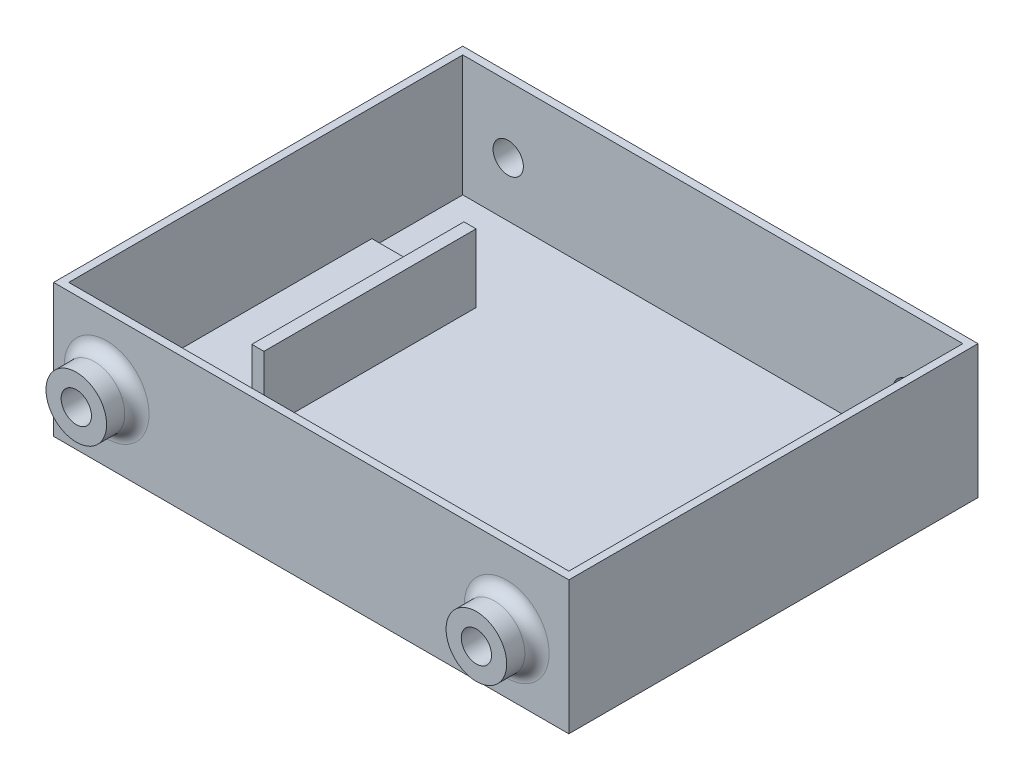
ISO-10303-21;
HEADER;
FILE_DESCRIPTION(('STEP AP214'),'2;1');
FILE_NAME('part.step','',(''),(''),'','','');
FILE_SCHEMA(('AUTOMOTIVE_DESIGN { 1 0 10303 214 1 1 1 1 }'));
ENDSEC;
DATA;
#1=APPLICATION_CONTEXT('core data for automotive mechanical design processes');
#2=APPLICATION_PROTOCOL_DEFINITION('international standard','automotive_design',2000,#1);
#3=PRODUCT_CONTEXT('',#1,'mechanical');
#4=PRODUCT('Part','Part','',(#3));
#5=PRODUCT_RELATED_PRODUCT_CATEGORY('part','',(#4));
#6=PRODUCT_DEFINITION_FORMATION('','',#4);
#7=PRODUCT_DEFINITION_CONTEXT('part definition',#1,'design');
#8=PRODUCT_DEFINITION('design','',#6,#7);
#9=PRODUCT_DEFINITION_SHAPE('','',#8);
#10=(LENGTH_UNIT() NAMED_UNIT(*) SI_UNIT(.MILLI.,.METRE.));
#11=(NAMED_UNIT(*) PLANE_ANGLE_UNIT() SI_UNIT($,.RADIAN.));
#12=(NAMED_UNIT(*) SI_UNIT($,.STERADIAN.) SOLID_ANGLE_UNIT());
#13=UNCERTAINTY_MEASURE_WITH_UNIT(LENGTH_MEASURE(1.E-05),#10,'distance_accuracy_value','');
#14=(GEOMETRIC_REPRESENTATION_CONTEXT(3) GLOBAL_UNCERTAINTY_ASSIGNED_CONTEXT((#13)) GLOBAL_UNIT_ASSIGNED_CONTEXT((#10,
#11,#12)) REPRESENTATION_CONTEXT('',''));
#15=CARTESIAN_POINT('',(0.,0.,0.));
#16=DIRECTION('',(0.,0.,1.));
#17=DIRECTION('',(1.,0.,0.));
#18=AXIS2_PLACEMENT_3D('',#15,#16,#17);
#19=CARTESIAN_POINT('',(0.,4.1275,0.));
#20=DIRECTION('',(0.,1.,0.));
#21=DIRECTION('',(0.,0.,1.));
#22=AXIS2_PLACEMENT_3D('',#19,#20,#21);
#23=PLANE('',#22);
#24=DIRECTION('',(1.,0.,0.));
#25=VECTOR('',#24,1.);
#26=CARTESIAN_POINT('',(23.4315,4.1275,-20.6375));
#27=LINE('',#26,#25);
#28=CARTESIAN_POINT('',(1.58750000000001,4.1275,-20.6375));
#29=VERTEX_POINT('',#28);
#30=CARTESIAN_POINT('',(20.8915,4.1275,-20.6375));
#31=VERTEX_POINT('',#30);
#32=EDGE_CURVE('E76',#29,#31,#27,.T.);
#33=ORIENTED_EDGE('',*,*,#32,.T.);
#34=DIRECTION('',(0.,0.,1.));
#35=VECTOR('',#34,1.);
#36=CARTESIAN_POINT('',(20.8915,4.1275,-65.0875));
#37=LINE('',#36,#35);
#38=CARTESIAN_POINT('',(20.8915,4.1275,-65.0875));
#39=VERTEX_POINT('',#38);
#40=EDGE_CURVE('E80',#39,#31,#37,.T.);
#41=ORIENTED_EDGE('',*,*,#40,.F.);
#42=DIRECTION('',(-1.,0.,0.));
#43=VECTOR('',#42,1.);
#44=CARTESIAN_POINT('',(23.4315,4.1275,-65.0875));
#45=LINE('',#44,#43);
#46=CARTESIAN_POINT('',(1.5875,4.1275,-65.0875));
#47=VERTEX_POINT('',#46);
#48=EDGE_CURVE('E199',#39,#47,#45,.T.);
#49=ORIENTED_EDGE('',*,*,#48,.T.);
#50=DIRECTION('',(0.,0.,1.));
#51=VECTOR('',#50,1.);
#52=CARTESIAN_POINT('',(1.5875,4.1275,-20.6375));
#53=LINE('',#52,#51);
#54=EDGE_CURVE('E201',#47,#29,#53,.T.);
#55=ORIENTED_EDGE('',*,*,#54,.T.);
#56=EDGE_LOOP('',(#33,#41,#49,#55));
#57=FACE_BOUND('',#56,.T.);
#58=ADVANCED_FACE('F61',(#57),#23,.T.);
#59=CARTESIAN_POINT('',(1.5875,27.94,-84.1375));
#60=DIRECTION('',(1.,0.,0.));
#61=DIRECTION('',(0.,0.,-1.));
#62=AXIS2_PLACEMENT_3D('',#59,#60,#61);
#63=PLANE('',#62);
#64=ORIENTED_EDGE('',*,*,#54,.F.);
#65=DIRECTION('',(0.,-1.,0.));
#66=VECTOR('',#65,1.);
#67=CARTESIAN_POINT('',(1.5875,4.1275,-65.0875));
#68=LINE('',#67,#66);
#69=CARTESIAN_POINT('',(1.5875,2.54,-65.0875));
#70=VERTEX_POINT('',#69);
#71=EDGE_CURVE('E172',#47,#70,#68,.T.);
#72=ORIENTED_EDGE('',*,*,#71,.T.);
#73=DIRECTION('',(0.,0.,1.));
#74=VECTOR('',#73,1.);
#75=CARTESIAN_POINT('',(1.5875,2.54,-84.1375));
#76=LINE('',#75,#74);
#77=CARTESIAN_POINT('',(1.5875,2.54,-84.1375));
#78=VERTEX_POINT('',#77);
#79=EDGE_CURVE('E228',#78,#70,#76,.T.);
#80=ORIENTED_EDGE('',*,*,#79,.F.);
#81=DIRECTION('',(0.,-1.,0.));
#82=VECTOR('',#81,1.);
#83=CARTESIAN_POINT('',(1.5875,27.94,-84.1375));
#84=LINE('',#83,#82);
#85=CARTESIAN_POINT('',(1.5875,27.94,-84.1375));
#86=VERTEX_POINT('',#85);
#87=EDGE_CURVE('E247',#86,#78,#84,.T.);
#88=ORIENTED_EDGE('',*,*,#87,.F.);
#89=DIRECTION('',(0.,0.,1.));
#90=VECTOR('',#89,1.);
#91=CARTESIAN_POINT('',(1.5875,27.94,-84.1375));
#92=LINE('',#91,#90);
#93=CARTESIAN_POINT('',(1.58750000000001,27.94,-1.5875));
#94=VERTEX_POINT('',#93);
#95=EDGE_CURVE('E234',#86,#94,#92,.T.);
#96=ORIENTED_EDGE('',*,*,#95,.T.);
#97=DIRECTION('',(0.,-1.,0.));
#98=VECTOR('',#97,1.);
#99=CARTESIAN_POINT('',(1.58750000000001,27.94,-1.5875));
#100=LINE('',#99,#98);
#101=CARTESIAN_POINT('',(1.58750000000001,2.54,-1.5875));
#102=VERTEX_POINT('',#101);
#103=EDGE_CURVE('E251',#94,#102,#100,.T.);
#104=ORIENTED_EDGE('',*,*,#103,.T.);
#105=CARTESIAN_POINT('',(1.58750000000001,2.54,-20.6375));
#106=VERTEX_POINT('',#105);
#107=EDGE_CURVE('E244',#106,#102,#76,.T.);
#108=ORIENTED_EDGE('',*,*,#107,.F.);
#109=DIRECTION('',(0.,-1.,0.));
#110=VECTOR('',#109,1.);
#111=CARTESIAN_POINT('',(1.5875,4.1275,-20.6375));
#112=LINE('',#111,#110);
#113=EDGE_CURVE('E212',#29,#106,#112,.T.);
#114=ORIENTED_EDGE('',*,*,#113,.F.);
#115=EDGE_LOOP('',(#64,#72,#80,#88,#96,#104,#108,#114));
#116=FACE_BOUND('',#115,.T.);
#117=ADVANCED_FACE('F364',(#116),#63,.T.);
#118=CARTESIAN_POINT('',(0.,2.54,0.));
#119=DIRECTION('',(0.,-1.,0.));
#120=DIRECTION('',(0.,0.,-1.));
#121=AXIS2_PLACEMENT_3D('',#118,#119,#120);
#122=PLANE('',#121);
#123=DIRECTION('',(-1.,0.,0.));
#124=VECTOR('',#123,1.);
#125=CARTESIAN_POINT('',(23.4315,2.54,-65.0875));
#126=LINE('',#125,#124);
#127=CARTESIAN_POINT('',(23.4315,2.54,-65.0875));
#128=VERTEX_POINT('',#127);
#129=EDGE_CURVE('E207',#128,#70,#126,.T.);
#130=ORIENTED_EDGE('',*,*,#129,.F.);
#131=DIRECTION('',(0.,0.,-1.));
#132=VECTOR('',#131,1.);
#133=CARTESIAN_POINT('',(23.4315,2.54,-20.6375));
#134=LINE('',#133,#132);
#135=CARTESIAN_POINT('',(23.4315,2.54,-20.6375));
#136=VERTEX_POINT('',#135);
#137=EDGE_CURVE('E167',#136,#128,#134,.T.);
#138=ORIENTED_EDGE('',*,*,#137,.F.);
#139=DIRECTION('',(1.,0.,0.));
#140=VECTOR('',#139,1.);
#141=CARTESIAN_POINT('',(23.4315,2.54,-20.6375));
#142=LINE('',#141,#140);
#143=EDGE_CURVE('E202',#106,#136,#142,.T.);
#144=ORIENTED_EDGE('',*,*,#143,.F.);
#145=ORIENTED_EDGE('',*,*,#107,.T.);
#146=DIRECTION('',(1.,0.,0.));
#147=VECTOR('',#146,1.);
#148=CARTESIAN_POINT('',(1.58750000000001,2.54,-1.5875));
#149=LINE('',#148,#147);
#150=CARTESIAN_POINT('',(106.3625,2.54,-1.58750000000001));
#151=VERTEX_POINT('',#150);
#152=EDGE_CURVE('E242',#102,#151,#149,.T.);
#153=ORIENTED_EDGE('',*,*,#152,.T.);
#154=DIRECTION('',(0.,0.,1.));
#155=VECTOR('',#154,1.);
#156=CARTESIAN_POINT('',(106.3625,2.54,-84.1375));
#157=LINE('',#156,#155);
#158=CARTESIAN_POINT('',(106.3625,2.54,-84.1375));
#159=VERTEX_POINT('',#158);
#160=EDGE_CURVE('E239',#159,#151,#157,.T.);
#161=ORIENTED_EDGE('',*,*,#160,.F.);
#162=DIRECTION('',(1.,0.,0.));
#163=VECTOR('',#162,1.);
#164=CARTESIAN_POINT('',(1.5875,2.54,-84.1375));
#165=LINE('',#164,#163);
#166=EDGE_CURVE('E223',#78,#159,#165,.T.);
#167=ORIENTED_EDGE('',*,*,#166,.F.);
#168=ORIENTED_EDGE('',*,*,#79,.T.);
#169=EDGE_LOOP('',(#130,#138,#144,#145,#153,#161,#167,#168));
#170=FACE_BOUND('',#169,.T.);
#171=ADVANCED_FACE('F369',(#170),#122,.F.);
#172=CARTESIAN_POINT('',(0.,2.54,0.));
#173=DIRECTION('',(-1.,0.,0.));
#174=DIRECTION('',(0.,0.,1.));
#175=AXIS2_PLACEMENT_3D('',#172,#173,#174);
#176=PLANE('',#175);
#177=DIRECTION('',(0.,0.,-1.));
#178=VECTOR('',#177,1.);
#179=CARTESIAN_POINT('',(0.,0.,0.));
#180=LINE('',#179,#178);
#181=CARTESIAN_POINT('',(0.,0.,0.));
#182=VERTEX_POINT('',#181);
#183=CARTESIAN_POINT('',(0.,0.,-85.725));
#184=VERTEX_POINT('',#183);
#185=EDGE_CURVE('E270',#182,#184,#180,.T.);
#186=ORIENTED_EDGE('',*,*,#185,.F.);
#187=DIRECTION('',(0.,-1.,0.));
#188=VECTOR('',#187,1.);
#189=CARTESIAN_POINT('',(0.,2.54,0.));
#190=LINE('',#189,#188);
#191=CARTESIAN_POINT('',(0.,27.94,0.));
#192=VERTEX_POINT('',#191);
#193=EDGE_CURVE('E282',#192,#182,#190,.T.);
#194=ORIENTED_EDGE('',*,*,#193,.F.);
#195=DIRECTION('',(0.,0.,1.));
#196=VECTOR('',#195,1.);
#197=CARTESIAN_POINT('',(0.,27.94,0.));
#198=LINE('',#197,#196);
#199=CARTESIAN_POINT('',(0.,27.94,-85.725));
#200=VERTEX_POINT('',#199);
#201=EDGE_CURVE('E261',#200,#192,#198,.T.);
#202=ORIENTED_EDGE('',*,*,#201,.F.);
#203=DIRECTION('',(0.,-1.,0.));
#204=VECTOR('',#203,1.);
#205=CARTESIAN_POINT('',(0.,2.54,-85.725));
#206=LINE('',#205,#204);
#207=EDGE_CURVE('E281',#200,#184,#206,.T.);
#208=ORIENTED_EDGE('',*,*,#207,.T.);
#209=EDGE_LOOP('',(#186,#194,#202,#208));
#210=FACE_BOUND('',#209,.T.);
#211=ADVANCED_FACE('F411',(#210),#176,.T.);
#212=CARTESIAN_POINT('',(0.,2.54,0.));
#213=DIRECTION('',(0.,0.,-1.));
#214=DIRECTION('',(-1.,0.,0.));
#215=AXIS2_PLACEMENT_3D('',#212,#213,#214);
#216=PLANE('',#215);
#217=CARTESIAN_POINT('',(94.9325,12.5146943034764,0.));
#218=DIRECTION('',(0.,0.,-1.));
#219=DIRECTION('',(-1.,0.,0.));
#220=AXIS2_PLACEMENT_3D('',#217,#218,#219);
#221=CIRCLE('',#220,8.89);
#222=CARTESIAN_POINT('',(86.0425,12.5146943034764,0.));
#223=VERTEX_POINT('',#222);
#224=EDGE_CURVE('E303',#223,#223,#221,.T.);
#225=ORIENTED_EDGE('',*,*,#224,.T.);
#226=EDGE_LOOP('',(#225));
#227=FACE_BOUND('',#226,.T.);
#228=CARTESIAN_POINT('',(11.1125,14.0281539984102,0.));
#229=DIRECTION('',(0.,0.,-1.));
#230=DIRECTION('',(-1.,0.,0.));
#231=AXIS2_PLACEMENT_3D('',#228,#229,#230);
#232=CIRCLE('',#231,8.89);
#233=CARTESIAN_POINT('',(2.2225,14.0281539984102,0.));
#234=VERTEX_POINT('',#233);
#235=EDGE_CURVE('E297',#234,#234,#232,.T.);
#236=ORIENTED_EDGE('',*,*,#235,.T.);
#237=EDGE_LOOP('',(#236));
#238=FACE_BOUND('',#237,.T.);
#239=DIRECTION('',(1.,0.,0.));
#240=VECTOR('',#239,1.);
#241=CARTESIAN_POINT('',(0.,0.,0.));
#242=LINE('',#241,#240);
#243=CARTESIAN_POINT('',(107.95,0.,0.));
#244=VERTEX_POINT('',#243);
#245=EDGE_CURVE('E279',#182,#244,#242,.T.);
#246=ORIENTED_EDGE('',*,*,#245,.T.);
#247=DIRECTION('',(0.,-1.,0.));
#248=VECTOR('',#247,1.);
#249=CARTESIAN_POINT('',(107.95,2.54,0.));
#250=LINE('',#249,#248);
#251=CARTESIAN_POINT('',(107.95,27.94,0.));
#252=VERTEX_POINT('',#251);
#253=EDGE_CURVE('E285',#252,#244,#250,.T.);
#254=ORIENTED_EDGE('',*,*,#253,.F.);
#255=DIRECTION('',(1.,0.,0.));
#256=VECTOR('',#255,1.);
#257=CARTESIAN_POINT('',(0.,27.94,0.));
#258=LINE('',#257,#256);
#259=EDGE_CURVE('E264',#192,#252,#258,.T.);
#260=ORIENTED_EDGE('',*,*,#259,.F.);
#261=ORIENTED_EDGE('',*,*,#193,.T.);
#262=EDGE_LOOP('',(#246,#254,#260,#261));
#263=FACE_BOUND('',#262,.T.);
#264=ADVANCED_FACE('F416',(#227,#238,#263),#216,.F.);
#265=CARTESIAN_POINT('',(107.95,2.54,0.));
#266=DIRECTION('',(-1.,0.,0.));
#267=DIRECTION('',(0.,0.,1.));
#268=AXIS2_PLACEMENT_3D('',#265,#266,#267);
#269=PLANE('',#268);
#270=DIRECTION('',(0.,0.,-1.));
#271=VECTOR('',#270,1.);
#272=CARTESIAN_POINT('',(107.95,0.,0.));
#273=LINE('',#272,#271);
#274=CARTESIAN_POINT('',(107.95,0.,-85.725));
#275=VERTEX_POINT('',#274);
#276=EDGE_CURVE('E276',#244,#275,#273,.T.);
#277=ORIENTED_EDGE('',*,*,#276,.T.);
#278=DIRECTION('',(0.,-1.,0.));
#279=VECTOR('',#278,1.);
#280=CARTESIAN_POINT('',(107.95,2.54,-85.725));
#281=LINE('',#280,#279);
#282=CARTESIAN_POINT('',(107.95,27.94,-85.725));
#283=VERTEX_POINT('',#282);
#284=EDGE_CURVE('E288',#283,#275,#281,.T.);
#285=ORIENTED_EDGE('',*,*,#284,.F.);
#286=DIRECTION('',(0.,0.,-1.));
#287=VECTOR('',#286,1.);
#288=CARTESIAN_POINT('',(107.95,27.94,0.));
#289=LINE('',#288,#287);
#290=EDGE_CURVE('E267',#252,#283,#289,.T.);
#291=ORIENTED_EDGE('',*,*,#290,.F.);
#292=ORIENTED_EDGE('',*,*,#253,.T.);
#293=EDGE_LOOP('',(#277,#285,#291,#292));
#294=FACE_BOUND('',#293,.T.);
#295=ADVANCED_FACE('F419',(#294),#269,.F.);
#296=CARTESIAN_POINT('',(0.,2.54,-85.725));
#297=DIRECTION('',(0.,0.,-1.));
#298=DIRECTION('',(-1.,0.,0.));
#299=AXIS2_PLACEMENT_3D('',#296,#297,#298);
#300=PLANE('',#299);
#301=CARTESIAN_POINT('',(11.1125,14.0281539984102,-85.725));
#302=DIRECTION('',(0.,0.,-1.));
#303=DIRECTION('',(-1.,0.,0.));
#304=AXIS2_PLACEMENT_3D('',#301,#302,#303);
#305=CIRCLE('',#304,8.89);
#306=CARTESIAN_POINT('',(2.2225,14.0281539984102,-85.725));
#307=VERTEX_POINT('',#306);
#308=EDGE_CURVE('E69',#307,#307,#305,.F.);
#309=ORIENTED_EDGE('',*,*,#308,.T.);
#310=EDGE_LOOP('',(#309));
#311=FACE_BOUND('',#310,.T.);
#312=CARTESIAN_POINT('',(94.9325,12.5146943034764,-85.725));
#313=DIRECTION('',(0.,0.,-1.));
#314=DIRECTION('',(-1.,0.,0.));
#315=AXIS2_PLACEMENT_3D('',#312,#313,#314);
#316=CIRCLE('',#315,8.89);
#317=CARTESIAN_POINT('',(86.0425,12.5146943034764,-85.725));
#318=VERTEX_POINT('',#317);
#319=EDGE_CURVE('E309',#318,#318,#316,.F.);
#320=ORIENTED_EDGE('',*,*,#319,.T.);
#321=EDGE_LOOP('',(#320));
#322=FACE_BOUND('',#321,.T.);
#323=DIRECTION('',(1.,0.,0.));
#324=VECTOR('',#323,1.);
#325=CARTESIAN_POINT('',(0.,0.,-85.725));
#326=LINE('',#325,#324);
#327=EDGE_CURVE('E273',#184,#275,#326,.T.);
#328=ORIENTED_EDGE('',*,*,#327,.F.);
#329=ORIENTED_EDGE('',*,*,#207,.F.);
#330=DIRECTION('',(-1.,0.,0.));
#331=VECTOR('',#330,1.);
#332=CARTESIAN_POINT('',(0.,27.94,-85.725));
#333=LINE('',#332,#331);
#334=EDGE_CURVE('E250',#283,#200,#333,.T.);
#335=ORIENTED_EDGE('',*,*,#334,.F.);
#336=ORIENTED_EDGE('',*,*,#284,.T.);
#337=EDGE_LOOP('',(#328,#329,#335,#336));
#338=FACE_BOUND('',#337,.T.);
#339=ADVANCED_FACE('F314',(#311,#322,#338),#300,.T.);
#340=CARTESIAN_POINT('',(0.,0.,0.));
#341=DIRECTION('',(0.,-1.,0.));
#342=DIRECTION('',(0.,0.,-1.));
#343=AXIS2_PLACEMENT_3D('',#340,#341,#342);
#344=PLANE('',#343);
#345=ORIENTED_EDGE('',*,*,#185,.T.);
#346=ORIENTED_EDGE('',*,*,#327,.T.);
#347=ORIENTED_EDGE('',*,*,#276,.F.);
#348=ORIENTED_EDGE('',*,*,#245,.F.);
#349=EDGE_LOOP('',(#345,#346,#347,#348));
#350=FACE_BOUND('',#349,.T.);
#351=ADVANCED_FACE('F407',(#350),#344,.T.);
#352=CARTESIAN_POINT('',(0.,27.94,0.));
#353=DIRECTION('',(0.,1.,0.));
#354=DIRECTION('',(0.,0.,1.));
#355=AXIS2_PLACEMENT_3D('',#352,#353,#354);
#356=PLANE('',#355);
#357=DIRECTION('',(1.,0.,0.));
#358=VECTOR('',#357,1.);
#359=CARTESIAN_POINT('',(1.5875,27.94,-84.1375));
#360=LINE('',#359,#358);
#361=CARTESIAN_POINT('',(106.3625,27.94,-84.1375));
#362=VERTEX_POINT('',#361);
#363=EDGE_CURVE('E224',#86,#362,#360,.T.);
#364=ORIENTED_EDGE('',*,*,#363,.T.);
#365=DIRECTION('',(0.,0.,1.));
#366=VECTOR('',#365,1.);
#367=CARTESIAN_POINT('',(106.3625,27.94,-84.1375));
#368=LINE('',#367,#366);
#369=CARTESIAN_POINT('',(106.3625,27.94,-1.58750000000001));
#370=VERTEX_POINT('',#369);
#371=EDGE_CURVE('E227',#362,#370,#368,.T.);
#372=ORIENTED_EDGE('',*,*,#371,.T.);
#373=DIRECTION('',(1.,0.,0.));
#374=VECTOR('',#373,1.);
#375=CARTESIAN_POINT('',(1.58750000000001,27.94,-1.5875));
#376=LINE('',#375,#374);
#377=EDGE_CURVE('E231',#94,#370,#376,.T.);
#378=ORIENTED_EDGE('',*,*,#377,.F.);
#379=ORIENTED_EDGE('',*,*,#95,.F.);
#380=EDGE_LOOP('',(#364,#372,#378,#379));
#381=FACE_BOUND('',#380,.T.);
#382=ORIENTED_EDGE('',*,*,#334,.T.);
#383=ORIENTED_EDGE('',*,*,#201,.T.);
#384=ORIENTED_EDGE('',*,*,#259,.T.);
#385=ORIENTED_EDGE('',*,*,#290,.T.);
#386=EDGE_LOOP('',(#382,#383,#384,#385));
#387=FACE_BOUND('',#386,.T.);
#388=ADVANCED_FACE('F403',(#381,#387),#356,.T.);
#389=CARTESIAN_POINT('',(1.5875,27.94,-84.1375));
#390=DIRECTION('',(0.,0.,-1.));
#391=DIRECTION('',(-1.,0.,0.));
#392=AXIS2_PLACEMENT_3D('',#389,#390,#391);
#393=PLANE('',#392);
#394=CARTESIAN_POINT('',(94.9325,12.5146943034764,-84.1375));
#395=DIRECTION('',(0.,0.,-1.));
#396=DIRECTION('',(-1.,0.,0.));
#397=AXIS2_PLACEMENT_3D('',#394,#395,#396);
#398=CIRCLE('',#397,3.175);
#399=CARTESIAN_POINT('',(91.7575,12.5146943034764,-84.1375));
#400=VERTEX_POINT('',#399);
#401=EDGE_CURVE('E216',#400,#400,#398,.T.);
#402=ORIENTED_EDGE('',*,*,#401,.T.);
#403=EDGE_LOOP('',(#402));
#404=FACE_BOUND('',#403,.T.);
#405=CARTESIAN_POINT('',(11.1125,14.0281539984102,-84.1375));
#406=DIRECTION('',(0.,0.,-1.));
#407=DIRECTION('',(-1.,0.,0.));
#408=AXIS2_PLACEMENT_3D('',#405,#406,#407);
#409=CIRCLE('',#408,3.175);
#410=CARTESIAN_POINT('',(7.9375,14.0281539984102,-84.1375));
#411=VERTEX_POINT('',#410);
#412=EDGE_CURVE('E220',#411,#411,#409,.T.);
#413=ORIENTED_EDGE('',*,*,#412,.T.);
#414=EDGE_LOOP('',(#413));
#415=FACE_BOUND('',#414,.T.);
#416=ORIENTED_EDGE('',*,*,#166,.T.);
#417=DIRECTION('',(0.,-1.,0.));
#418=VECTOR('',#417,1.);
#419=CARTESIAN_POINT('',(106.3625,27.94,-84.1375));
#420=LINE('',#419,#418);
#421=EDGE_CURVE('E236',#362,#159,#420,.T.);
#422=ORIENTED_EDGE('',*,*,#421,.F.);
#423=ORIENTED_EDGE('',*,*,#363,.F.);
#424=ORIENTED_EDGE('',*,*,#87,.T.);
#425=EDGE_LOOP('',(#416,#422,#423,#424));
#426=FACE_BOUND('',#425,.T.);
#427=ADVANCED_FACE('F396',(#404,#415,#426),#393,.F.);
#428=CARTESIAN_POINT('',(1.58750000000001,27.94,-1.5875));
#429=DIRECTION('',(0.,0.,-1.));
#430=DIRECTION('',(-1.,0.,0.));
#431=AXIS2_PLACEMENT_3D('',#428,#429,#430);
#432=PLANE('',#431);
#433=CARTESIAN_POINT('',(94.9325,12.5146943034764,-1.58750000000001));
#434=DIRECTION('',(0.,0.,-1.));
#435=DIRECTION('',(-1.,0.,0.));
#436=AXIS2_PLACEMENT_3D('',#433,#434,#435);
#437=CIRCLE('',#436,3.175);
#438=CARTESIAN_POINT('',(91.7575,12.5146943034764,-1.5875));
#439=VERTEX_POINT('',#438);
#440=EDGE_CURVE('E171',#439,#439,#437,.T.);
#441=ORIENTED_EDGE('',*,*,#440,.F.);
#442=EDGE_LOOP('',(#441));
#443=FACE_BOUND('',#442,.T.);
#444=CARTESIAN_POINT('',(11.1125,14.0281539984102,-1.5875));
#445=DIRECTION('',(0.,0.,-1.));
#446=DIRECTION('',(-1.,0.,0.));
#447=AXIS2_PLACEMENT_3D('',#444,#445,#446);
#448=CIRCLE('',#447,3.175);
#449=CARTESIAN_POINT('',(7.9375,14.0281539984102,-1.5875));
#450=VERTEX_POINT('',#449);
#451=EDGE_CURVE('E219',#450,#450,#448,.T.);
#452=ORIENTED_EDGE('',*,*,#451,.F.);
#453=EDGE_LOOP('',(#452));
#454=FACE_BOUND('',#453,.T.);
#455=ORIENTED_EDGE('',*,*,#152,.F.);
#456=ORIENTED_EDGE('',*,*,#103,.F.);
#457=ORIENTED_EDGE('',*,*,#377,.T.);
#458=DIRECTION('',(0.,-1.,0.));
#459=VECTOR('',#458,1.);
#460=CARTESIAN_POINT('',(106.3625,27.94,-1.58750000000001));
#461=LINE('',#460,#459);
#462=EDGE_CURVE('E254',#370,#151,#461,.T.);
#463=ORIENTED_EDGE('',*,*,#462,.T.);
#464=EDGE_LOOP('',(#455,#456,#457,#463));
#465=FACE_BOUND('',#464,.T.);
#466=ADVANCED_FACE('F393',(#443,#454,#465),#432,.T.);
#467=CARTESIAN_POINT('',(106.3625,27.94,-84.1375));
#468=DIRECTION('',(1.,0.,0.));
#469=DIRECTION('',(0.,0.,-1.));
#470=AXIS2_PLACEMENT_3D('',#467,#468,#469);
#471=PLANE('',#470);
#472=ORIENTED_EDGE('',*,*,#160,.T.);
#473=ORIENTED_EDGE('',*,*,#462,.F.);
#474=ORIENTED_EDGE('',*,*,#371,.F.);
#475=ORIENTED_EDGE('',*,*,#421,.T.);
#476=EDGE_LOOP('',(#472,#473,#474,#475));
#477=FACE_BOUND('',#476,.T.);
#478=ADVANCED_FACE('F390',(#477),#471,.F.);
#479=CARTESIAN_POINT('',(11.1125,14.0281539984102,0.));
#480=DIRECTION('',(0.,0.,-1.));
#481=DIRECTION('',(-1.,0.,0.));
#482=AXIS2_PLACEMENT_3D('',#479,#480,#481);
#483=CYLINDRICAL_SURFACE('',#482,3.175);
#484=ORIENTED_EDGE('',*,*,#451,.T.);
#485=EDGE_LOOP('',(#484));
#486=FACE_BOUND('',#485,.T.);
#487=CARTESIAN_POINT('',(11.1125,14.0281539984102,6.34999999999999));
#488=DIRECTION('',(0.,0.,1.));
#489=DIRECTION('',(1.,0.,0.));
#490=AXIS2_PLACEMENT_3D('',#487,#488,#489);
#491=CIRCLE('',#490,3.175);
#492=CARTESIAN_POINT('',(14.2875,14.0281539984102,6.34999999999999));
#493=VERTEX_POINT('',#492);
#494=EDGE_CURVE('E467',#493,#493,#491,.T.);
#495=ORIENTED_EDGE('',*,*,#494,.T.);
#496=EDGE_LOOP('',(#495));
#497=FACE_BOUND('',#496,.T.);
#498=ADVANCED_FACE('F388',(#486,#497),#483,.F.);
#499=ORIENTED_EDGE('',*,*,#412,.F.);
#500=EDGE_LOOP('',(#499));
#501=FACE_BOUND('',#500,.T.);
#502=CARTESIAN_POINT('',(11.1125,14.0281539984102,-92.075));
#503=DIRECTION('',(0.,0.,1.));
#504=DIRECTION('',(1.,0.,0.));
#505=AXIS2_PLACEMENT_3D('',#502,#503,#504);
#506=CIRCLE('',#505,3.175);
#507=CARTESIAN_POINT('',(14.2875,14.0281539984102,-92.075));
#508=VERTEX_POINT('',#507);
#509=EDGE_CURVE('E465',#508,#508,#506,.T.);
#510=ORIENTED_EDGE('',*,*,#509,.F.);
#511=EDGE_LOOP('',(#510));
#512=FACE_BOUND('',#511,.T.);
#513=ADVANCED_FACE('F386',(#501,#512),#483,.F.);
#514=CARTESIAN_POINT('',(94.9325,12.5146943034764,0.));
#515=DIRECTION('',(0.,0.,-1.));
#516=DIRECTION('',(-1.,0.,0.));
#517=AXIS2_PLACEMENT_3D('',#514,#515,#516);
#518=CYLINDRICAL_SURFACE('',#517,3.175);
#519=ORIENTED_EDGE('',*,*,#440,.T.);
#520=EDGE_LOOP('',(#519));
#521=FACE_BOUND('',#520,.T.);
#522=CARTESIAN_POINT('',(94.9325,12.5146943034764,6.34999999999999));
#523=DIRECTION('',(0.,0.,1.));
#524=DIRECTION('',(1.,0.,0.));
#525=AXIS2_PLACEMENT_3D('',#522,#523,#524);
#526=CIRCLE('',#525,3.175);
#527=CARTESIAN_POINT('',(98.1075,12.5146943034764,6.34999999999999));
#528=VERTEX_POINT('',#527);
#529=EDGE_CURVE('E339',#528,#528,#526,.T.);
#530=ORIENTED_EDGE('',*,*,#529,.T.);
#531=EDGE_LOOP('',(#530));
#532=FACE_BOUND('',#531,.T.);
#533=ADVANCED_FACE('F383',(#521,#532),#518,.F.);
#534=ORIENTED_EDGE('',*,*,#401,.F.);
#535=EDGE_LOOP('',(#534));
#536=FACE_BOUND('',#535,.T.);
#537=CARTESIAN_POINT('',(94.9325,12.5146943034764,-92.075));
#538=DIRECTION('',(0.,0.,1.));
#539=DIRECTION('',(1.,0.,0.));
#540=AXIS2_PLACEMENT_3D('',#537,#538,#539);
#541=CIRCLE('',#540,3.175);
#542=CARTESIAN_POINT('',(98.1075,12.5146943034764,-92.075));
#543=VERTEX_POINT('',#542);
#544=EDGE_CURVE('E333',#543,#543,#541,.T.);
#545=ORIENTED_EDGE('',*,*,#544,.F.);
#546=EDGE_LOOP('',(#545));
#547=FACE_BOUND('',#546,.T.);
#548=ADVANCED_FACE('F382',(#536,#547),#518,.F.);
#549=CARTESIAN_POINT('',(23.4315,4.1275,-20.6375));
#550=DIRECTION('',(-1.,0.,0.));
#551=DIRECTION('',(0.,0.,1.));
#552=AXIS2_PLACEMENT_3D('',#549,#550,#551);
#553=PLANE('',#552);
#554=ORIENTED_EDGE('',*,*,#137,.T.);
#555=DIRECTION('',(0.,-1.,0.));
#556=VECTOR('',#555,1.);
#557=CARTESIAN_POINT('',(23.4315,4.1275,-65.0875));
#558=LINE('',#557,#556);
#559=CARTESIAN_POINT('',(23.4315,16.8275,-65.0875));
#560=VERTEX_POINT('',#559);
#561=EDGE_CURVE('E162',#560,#128,#558,.T.);
#562=ORIENTED_EDGE('',*,*,#561,.F.);
#563=DIRECTION('',(0.,0.,1.));
#564=VECTOR('',#563,1.);
#565=CARTESIAN_POINT('',(23.4315,16.8275,-65.0875));
#566=LINE('',#565,#564);
#567=CARTESIAN_POINT('',(23.4315,16.8275,-20.6375));
#568=VERTEX_POINT('',#567);
#569=EDGE_CURVE('E166',#560,#568,#566,.T.);
#570=ORIENTED_EDGE('',*,*,#569,.T.);
#571=DIRECTION('',(0.,-1.,0.));
#572=VECTOR('',#571,1.);
#573=CARTESIAN_POINT('',(23.4315,4.1275,-20.6375));
#574=LINE('',#573,#572);
#575=EDGE_CURVE('E205',#568,#136,#574,.T.);
#576=ORIENTED_EDGE('',*,*,#575,.T.);
#577=EDGE_LOOP('',(#554,#562,#570,#576));
#578=FACE_BOUND('',#577,.T.);
#579=ADVANCED_FACE('F164',(#578),#553,.F.);
#580=CARTESIAN_POINT('',(23.4315,4.1275,-65.0875));
#581=DIRECTION('',(0.,0.,1.));
#582=DIRECTION('',(1.,0.,0.));
#583=AXIS2_PLACEMENT_3D('',#580,#581,#582);
#584=PLANE('',#583);
#585=ORIENTED_EDGE('',*,*,#129,.T.);
#586=ORIENTED_EDGE('',*,*,#71,.F.);
#587=ORIENTED_EDGE('',*,*,#48,.F.);
#588=DIRECTION('',(0.,-1.,0.));
#589=VECTOR('',#588,1.);
#590=CARTESIAN_POINT('',(20.8915,16.8275,-65.0875));
#591=LINE('',#590,#589);
#592=CARTESIAN_POINT('',(20.8915,16.8275,-65.0875));
#593=VERTEX_POINT('',#592);
#594=EDGE_CURVE('E184',#593,#39,#591,.T.);
#595=ORIENTED_EDGE('',*,*,#594,.F.);
#596=DIRECTION('',(1.,0.,0.));
#597=VECTOR('',#596,1.);
#598=CARTESIAN_POINT('',(20.8915,16.8275,-65.0875));
#599=LINE('',#598,#597);
#600=EDGE_CURVE('E178',#593,#560,#599,.T.);
#601=ORIENTED_EDGE('',*,*,#600,.T.);
#602=ORIENTED_EDGE('',*,*,#561,.T.);
#603=EDGE_LOOP('',(#585,#586,#587,#595,#601,#602));
#604=FACE_BOUND('',#603,.T.);
#605=ADVANCED_FACE('F182',(#604),#584,.F.);
#606=CARTESIAN_POINT('',(23.4315,4.1275,-20.6375));
#607=DIRECTION('',(0.,0.,-1.));
#608=DIRECTION('',(-1.,0.,0.));
#609=AXIS2_PLACEMENT_3D('',#606,#607,#608);
#610=PLANE('',#609);
#611=ORIENTED_EDGE('',*,*,#143,.T.);
#612=ORIENTED_EDGE('',*,*,#575,.F.);
#613=DIRECTION('',(1.,0.,0.));
#614=VECTOR('',#613,1.);
#615=CARTESIAN_POINT('',(20.8915,16.8275,-20.6375));
#616=LINE('',#615,#614);
#617=CARTESIAN_POINT('',(20.8915,16.8275,-20.6375));
#618=VERTEX_POINT('',#617);
#619=EDGE_CURVE('E180',#618,#568,#616,.T.);
#620=ORIENTED_EDGE('',*,*,#619,.F.);
#621=DIRECTION('',(0.,-1.,0.));
#622=VECTOR('',#621,1.);
#623=CARTESIAN_POINT('',(20.8915,16.8275,-20.6375));
#624=LINE('',#623,#622);
#625=EDGE_CURVE('E194',#618,#31,#624,.T.);
#626=ORIENTED_EDGE('',*,*,#625,.T.);
#627=ORIENTED_EDGE('',*,*,#32,.F.);
#628=ORIENTED_EDGE('',*,*,#113,.T.);
#629=EDGE_LOOP('',(#611,#612,#620,#626,#627,#628));
#630=FACE_BOUND('',#629,.T.);
#631=ADVANCED_FACE('F374',(#630),#610,.F.);
#632=CARTESIAN_POINT('',(20.8915,16.8275,-65.0875));
#633=DIRECTION('',(1.,0.,0.));
#634=DIRECTION('',(0.,0.,-1.));
#635=AXIS2_PLACEMENT_3D('',#632,#633,#634);
#636=PLANE('',#635);
#637=ORIENTED_EDGE('',*,*,#40,.T.);
#638=ORIENTED_EDGE('',*,*,#625,.F.);
#639=DIRECTION('',(0.,0.,1.));
#640=VECTOR('',#639,1.);
#641=CARTESIAN_POINT('',(20.8915,16.8275,-65.0875));
#642=LINE('',#641,#640);
#643=EDGE_CURVE('E193',#593,#618,#642,.T.);
#644=ORIENTED_EDGE('',*,*,#643,.F.);
#645=ORIENTED_EDGE('',*,*,#594,.T.);
#646=EDGE_LOOP('',(#637,#638,#644,#645));
#647=FACE_BOUND('',#646,.T.);
#648=ADVANCED_FACE('F361',(#647),#636,.F.);
#649=CARTESIAN_POINT('',(0.,16.8275,0.));
#650=DIRECTION('',(0.,-1.,0.));
#651=DIRECTION('',(0.,0.,-1.));
#652=AXIS2_PLACEMENT_3D('',#649,#650,#651);
#653=PLANE('',#652);
#654=ORIENTED_EDGE('',*,*,#600,.F.);
#655=ORIENTED_EDGE('',*,*,#643,.T.);
#656=ORIENTED_EDGE('',*,*,#619,.T.);
#657=ORIENTED_EDGE('',*,*,#569,.F.);
#658=EDGE_LOOP('',(#654,#655,#656,#657));
#659=FACE_BOUND('',#658,.T.);
#660=ADVANCED_FACE('F177',(#659),#653,.F.);
#661=CARTESIAN_POINT('',(11.1125,14.0281539984102,6.35));
#662=DIRECTION('',(0.,0.,-1.));
#663=DIRECTION('',(-1.,0.,0.));
#664=AXIS2_PLACEMENT_3D('',#661,#662,#663);
#665=CYLINDRICAL_SURFACE('',#664,6.35);
#666=CARTESIAN_POINT('',(11.1125,14.0281539984102,2.54));
#667=DIRECTION('',(0.,0.,-1.));
#668=DIRECTION('',(-1.,0.,0.));
#669=AXIS2_PLACEMENT_3D('',#666,#667,#668);
#670=CIRCLE('',#669,6.35);
#671=CARTESIAN_POINT('',(4.7625,14.0281539984102,2.54));
#672=VERTEX_POINT('',#671);
#673=EDGE_CURVE('E284',#672,#672,#670,.F.);
#674=ORIENTED_EDGE('',*,*,#673,.T.);
#675=EDGE_LOOP('',(#674));
#676=FACE_BOUND('',#675,.T.);
#677=CARTESIAN_POINT('',(11.1125,14.0281539984102,6.35));
#678=DIRECTION('',(0.,0.,1.));
#679=DIRECTION('',(1.,0.,0.));
#680=AXIS2_PLACEMENT_3D('',#677,#678,#679);
#681=CIRCLE('',#680,6.35);
#682=CARTESIAN_POINT('',(17.4625,14.0281539984102,6.35));
#683=VERTEX_POINT('',#682);
#684=EDGE_CURVE('E187',#683,#683,#681,.T.);
#685=ORIENTED_EDGE('',*,*,#684,.F.);
#686=EDGE_LOOP('',(#685));
#687=FACE_BOUND('',#686,.T.);
#688=ADVANCED_FACE('F350',(#676,#687),#665,.T.);
#689=CARTESIAN_POINT('',(11.1125,14.0281539984102,6.35));
#690=DIRECTION('',(0.,0.,1.));
#691=DIRECTION('',(1.,0.,0.));
#692=AXIS2_PLACEMENT_3D('',#689,#690,#691);
#693=PLANE('',#692);
#694=ORIENTED_EDGE('',*,*,#494,.F.);
#695=EDGE_LOOP('',(#694));
#696=FACE_BOUND('',#695,.T.);
#697=ORIENTED_EDGE('',*,*,#684,.T.);
#698=EDGE_LOOP('',(#697));
#699=FACE_BOUND('',#698,.T.);
#700=ADVANCED_FACE('F348',(#696,#699),#693,.T.);
#701=CARTESIAN_POINT('',(94.9325,12.5146943034764,6.35));
#702=DIRECTION('',(0.,0.,-1.));
#703=DIRECTION('',(-1.,0.,0.));
#704=AXIS2_PLACEMENT_3D('',#701,#702,#703);
#705=CYLINDRICAL_SURFACE('',#704,6.35);
#706=CARTESIAN_POINT('',(94.9325,12.5146943034764,2.54));
#707=DIRECTION('',(0.,0.,-1.));
#708=DIRECTION('',(-1.,0.,0.));
#709=AXIS2_PLACEMENT_3D('',#706,#707,#708);
#710=CIRCLE('',#709,6.35);
#711=CARTESIAN_POINT('',(88.5825,12.5146943034764,2.54));
#712=VERTEX_POINT('',#711);
#713=EDGE_CURVE('E300',#712,#712,#710,.F.);
#714=ORIENTED_EDGE('',*,*,#713,.T.);
#715=EDGE_LOOP('',(#714));
#716=FACE_BOUND('',#715,.T.);
#717=CARTESIAN_POINT('',(94.9325,12.5146943034764,6.35));
#718=DIRECTION('',(0.,0.,1.));
#719=DIRECTION('',(1.,0.,0.));
#720=AXIS2_PLACEMENT_3D('',#717,#718,#719);
#721=CIRCLE('',#720,6.35);
#722=CARTESIAN_POINT('',(101.2825,12.5146943034764,6.35));
#723=VERTEX_POINT('',#722);
#724=EDGE_CURVE('E336',#723,#723,#721,.T.);
#725=ORIENTED_EDGE('',*,*,#724,.F.);
#726=EDGE_LOOP('',(#725));
#727=FACE_BOUND('',#726,.T.);
#728=ADVANCED_FACE('F358',(#716,#727),#705,.T.);
#729=CARTESIAN_POINT('',(94.9325,12.5146943034764,6.35));
#730=DIRECTION('',(0.,0.,1.));
#731=DIRECTION('',(1.,0.,0.));
#732=AXIS2_PLACEMENT_3D('',#729,#730,#731);
#733=PLANE('',#732);
#734=ORIENTED_EDGE('',*,*,#529,.F.);
#735=EDGE_LOOP('',(#734));
#736=FACE_BOUND('',#735,.T.);
#737=ORIENTED_EDGE('',*,*,#724,.T.);
#738=EDGE_LOOP('',(#737));
#739=FACE_BOUND('',#738,.T.);
#740=ADVANCED_FACE('F433',(#736,#739),#733,.T.);
#741=CARTESIAN_POINT('',(11.1125,14.0281539984102,2.54));
#742=DIRECTION('',(0.,0.,-1.));
#743=DIRECTION('',(-1.,0.,0.));
#744=AXIS2_PLACEMENT_3D('',#741,#742,#743);
#745=TOROIDAL_SURFACE('',#744,8.89,2.54);
#746=ORIENTED_EDGE('',*,*,#235,.F.);
#747=EDGE_LOOP('',(#746));
#748=FACE_BOUND('',#747,.T.);
#749=ORIENTED_EDGE('',*,*,#673,.F.);
#750=EDGE_LOOP('',(#749));
#751=FACE_BOUND('',#750,.T.);
#752=ADVANCED_FACE('F429',(#748,#751),#745,.F.);
#753=CARTESIAN_POINT('',(94.9325,12.5146943034764,2.54));
#754=DIRECTION('',(0.,0.,-1.));
#755=DIRECTION('',(-1.,0.,0.));
#756=AXIS2_PLACEMENT_3D('',#753,#754,#755);
#757=TOROIDAL_SURFACE('',#756,8.89,2.54);
#758=ORIENTED_EDGE('',*,*,#224,.F.);
#759=EDGE_LOOP('',(#758));
#760=FACE_BOUND('',#759,.T.);
#761=ORIENTED_EDGE('',*,*,#713,.F.);
#762=EDGE_LOOP('',(#761));
#763=FACE_BOUND('',#762,.T.);
#764=ADVANCED_FACE('F432',(#760,#763),#757,.F.);
#765=CARTESIAN_POINT('',(94.9325,12.5146943034764,-92.075));
#766=DIRECTION('',(0.,0.,1.));
#767=DIRECTION('',(1.,0.,0.));
#768=AXIS2_PLACEMENT_3D('',#765,#766,#767);
#769=CYLINDRICAL_SURFACE('',#768,6.35);
#770=CARTESIAN_POINT('',(94.9325,12.5146943034764,-88.265));
#771=DIRECTION('',(0.,0.,-1.));
#772=DIRECTION('',(-1.,0.,0.));
#773=AXIS2_PLACEMENT_3D('',#770,#771,#772);
#774=CIRCLE('',#773,6.35);
#775=CARTESIAN_POINT('',(88.5825,12.5146943034764,-88.265));
#776=VERTEX_POINT('',#775);
#777=EDGE_CURVE('E12',#776,#776,#774,.T.);
#778=ORIENTED_EDGE('',*,*,#777,.T.);
#779=EDGE_LOOP('',(#778));
#780=FACE_BOUND('',#779,.T.);
#781=CARTESIAN_POINT('',(94.9325,12.5146943034764,-92.075));
#782=DIRECTION('',(0.,0.,-1.));
#783=DIRECTION('',(-1.,0.,0.));
#784=AXIS2_PLACEMENT_3D('',#781,#782,#783);
#785=CIRCLE('',#784,6.35);
#786=CARTESIAN_POINT('',(88.5825,12.5146943034764,-92.075));
#787=VERTEX_POINT('',#786);
#788=EDGE_CURVE('E332',#787,#787,#785,.T.);
#789=ORIENTED_EDGE('',*,*,#788,.F.);
#790=EDGE_LOOP('',(#789));
#791=FACE_BOUND('',#790,.T.);
#792=ADVANCED_FACE('F436',(#780,#791),#769,.T.);
#793=CARTESIAN_POINT('',(94.9325,12.5146943034764,-92.075));
#794=DIRECTION('',(0.,0.,-1.));
#795=DIRECTION('',(-1.,0.,0.));
#796=AXIS2_PLACEMENT_3D('',#793,#794,#795);
#797=PLANE('',#796);
#798=ORIENTED_EDGE('',*,*,#544,.T.);
#799=EDGE_LOOP('',(#798));
#800=FACE_BOUND('',#799,.T.);
#801=ORIENTED_EDGE('',*,*,#788,.T.);
#802=EDGE_LOOP('',(#801));
#803=FACE_BOUND('',#802,.T.);
#804=ADVANCED_FACE('F326',(#800,#803),#797,.T.);
#805=CARTESIAN_POINT('',(11.1125,14.0281539984102,-92.075));
#806=DIRECTION('',(0.,0.,1.));
#807=DIRECTION('',(1.,0.,0.));
#808=AXIS2_PLACEMENT_3D('',#805,#806,#807);
#809=CYLINDRICAL_SURFACE('',#808,6.35);
#810=CARTESIAN_POINT('',(11.1125,14.0281539984102,-88.265));
#811=DIRECTION('',(0.,0.,-1.));
#812=DIRECTION('',(-1.,0.,0.));
#813=AXIS2_PLACEMENT_3D('',#810,#811,#812);
#814=CIRCLE('',#813,6.35);
#815=CARTESIAN_POINT('',(4.7625,14.0281539984102,-88.265));
#816=VERTEX_POINT('',#815);
#817=EDGE_CURVE('E306',#816,#816,#814,.T.);
#818=ORIENTED_EDGE('',*,*,#817,.T.);
#819=EDGE_LOOP('',(#818));
#820=FACE_BOUND('',#819,.T.);
#821=CARTESIAN_POINT('',(11.1125,14.0281539984102,-92.075));
#822=DIRECTION('',(0.,0.,-1.));
#823=DIRECTION('',(-1.,0.,0.));
#824=AXIS2_PLACEMENT_3D('',#821,#822,#823);
#825=CIRCLE('',#824,6.35);
#826=CARTESIAN_POINT('',(4.7625,14.0281539984102,-92.075));
#827=VERTEX_POINT('',#826);
#828=EDGE_CURVE('E330',#827,#827,#825,.T.);
#829=ORIENTED_EDGE('',*,*,#828,.F.);
#830=EDGE_LOOP('',(#829));
#831=FACE_BOUND('',#830,.T.);
#832=ADVANCED_FACE('F323',(#820,#831),#809,.T.);
#833=CARTESIAN_POINT('',(11.1125,14.0281539984102,-92.075));
#834=DIRECTION('',(0.,0.,-1.));
#835=DIRECTION('',(-1.,0.,0.));
#836=AXIS2_PLACEMENT_3D('',#833,#834,#835);
#837=PLANE('',#836);
#838=ORIENTED_EDGE('',*,*,#509,.T.);
#839=EDGE_LOOP('',(#838));
#840=FACE_BOUND('',#839,.T.);
#841=ORIENTED_EDGE('',*,*,#828,.T.);
#842=EDGE_LOOP('',(#841));
#843=FACE_BOUND('',#842,.T.);
#844=ADVANCED_FACE('F320',(#840,#843),#837,.T.);
#845=CARTESIAN_POINT('',(11.1125,14.0281539984102,-88.265));
#846=DIRECTION('',(0.,0.,-1.));
#847=DIRECTION('',(-1.,0.,0.));
#848=AXIS2_PLACEMENT_3D('',#845,#846,#847);
#849=TOROIDAL_SURFACE('',#848,8.89,2.54);
#850=ORIENTED_EDGE('',*,*,#308,.F.);
#851=EDGE_LOOP('',(#850));
#852=FACE_BOUND('',#851,.T.);
#853=ORIENTED_EDGE('',*,*,#817,.F.);
#854=EDGE_LOOP('',(#853));
#855=FACE_BOUND('',#854,.T.);
#856=ADVANCED_FACE('F317',(#852,#855),#849,.F.);
#857=CARTESIAN_POINT('',(94.9325,12.5146943034764,-88.265));
#858=DIRECTION('',(0.,0.,-1.));
#859=DIRECTION('',(-1.,0.,0.));
#860=AXIS2_PLACEMENT_3D('',#857,#858,#859);
#861=TOROIDAL_SURFACE('',#860,8.89,2.54);
#862=ORIENTED_EDGE('',*,*,#319,.F.);
#863=EDGE_LOOP('',(#862));
#864=FACE_BOUND('',#863,.T.);
#865=ORIENTED_EDGE('',*,*,#777,.F.);
#866=EDGE_LOOP('',(#865));
#867=FACE_BOUND('',#866,.T.);
#868=ADVANCED_FACE('F63',(#864,#867),#861,.F.);
#869=CLOSED_SHELL('',(#58,#117,#171,#211,#264,#295,#339,#351,#388,#427,#466,#478,#498,#513,#533,
#548,#579,#605,#631,#648,#660,#688,#700,#728,#740,#752,#764,#792,#804,#832,#844,#856,#868));
#870=MANIFOLD_SOLID_BREP('B2',#869);
#871=ADVANCED_BREP_SHAPE_REPRESENTATION('',(#18,#870),#14);
#872=SHAPE_DEFINITION_REPRESENTATION(#9,#871);
ENDSEC;
END-ISO-10303-21;
